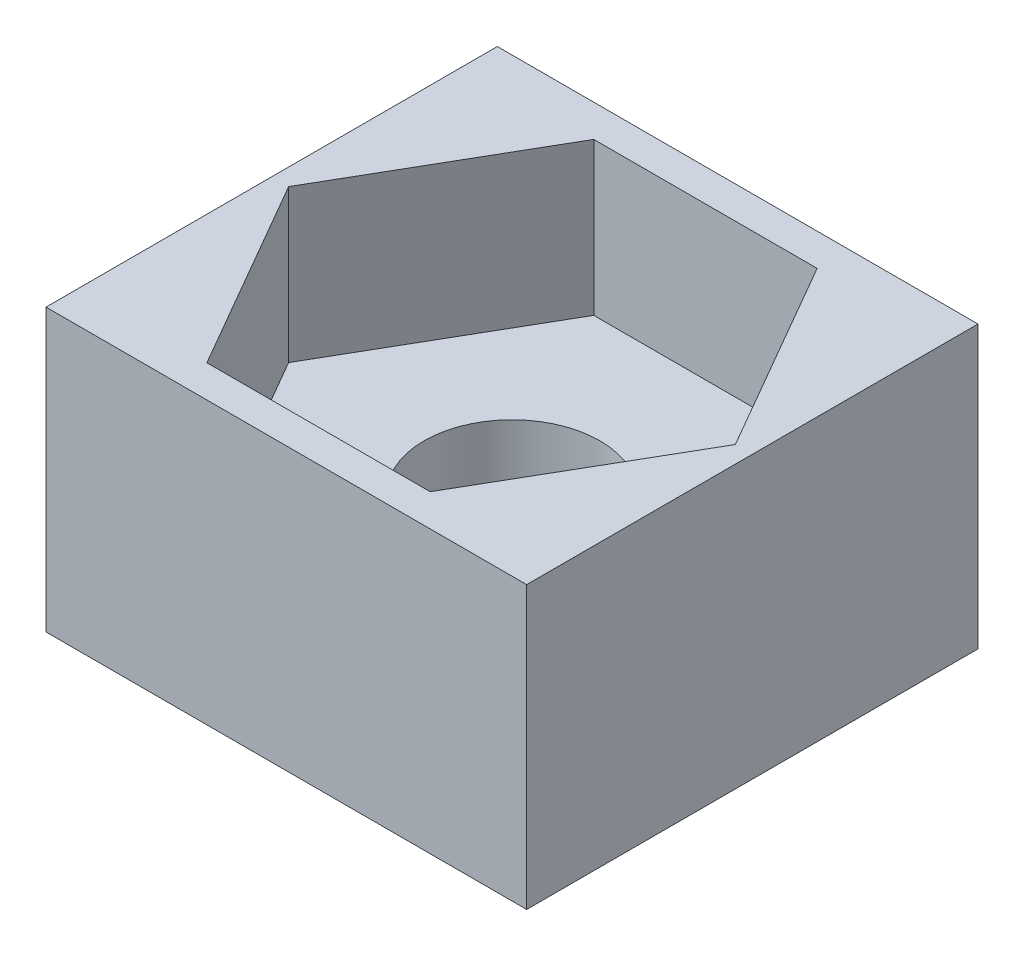
ISO-10303-21;
HEADER;
FILE_DESCRIPTION(('STEP AP214'),'2;1');
FILE_NAME('part.step','',(''),(''),'','','');
FILE_SCHEMA(('AUTOMOTIVE_DESIGN { 1 0 10303 214 1 1 1 1 }'));
ENDSEC;
DATA;
#1=APPLICATION_CONTEXT('core data for automotive mechanical design processes');
#2=APPLICATION_PROTOCOL_DEFINITION('international standard','automotive_design',2000,#1);
#3=PRODUCT_CONTEXT('',#1,'mechanical');
#4=PRODUCT('Part','Part','',(#3));
#5=PRODUCT_RELATED_PRODUCT_CATEGORY('part','',(#4));
#6=PRODUCT_DEFINITION_FORMATION('','',#4);
#7=PRODUCT_DEFINITION_CONTEXT('part definition',#1,'design');
#8=PRODUCT_DEFINITION('design','',#6,#7);
#9=PRODUCT_DEFINITION_SHAPE('','',#8);
#10=(LENGTH_UNIT() NAMED_UNIT(*) SI_UNIT(.MILLI.,.METRE.));
#11=(NAMED_UNIT(*) PLANE_ANGLE_UNIT() SI_UNIT($,.RADIAN.));
#12=(NAMED_UNIT(*) SI_UNIT($,.STERADIAN.) SOLID_ANGLE_UNIT());
#13=UNCERTAINTY_MEASURE_WITH_UNIT(LENGTH_MEASURE(1.E-05),#10,'distance_accuracy_value','');
#14=(GEOMETRIC_REPRESENTATION_CONTEXT(3) GLOBAL_UNCERTAINTY_ASSIGNED_CONTEXT((#13)) GLOBAL_UNIT_ASSIGNED_CONTEXT((#10,
#11,#12)) REPRESENTATION_CONTEXT('',''));
#15=CARTESIAN_POINT('',(0.,0.,0.));
#16=DIRECTION('',(0.,0.,1.));
#17=DIRECTION('',(1.,0.,0.));
#18=AXIS2_PLACEMENT_3D('',#15,#16,#17);
#19=CARTESIAN_POINT('',(2.85788383248865,4.8,1.65));
#20=DIRECTION('',(-0.866025403784439,0.,-0.5));
#21=DIRECTION('',(-0.5,0.,0.866025403784439));
#22=AXIS2_PLACEMENT_3D('',#19,#20,#21);
#23=PLANE('',#22);
#24=DIRECTION('',(0.5,0.,-0.866025403784439));
#25=VECTOR('',#24,1.);
#26=CARTESIAN_POINT('',(2.85788383248865,2.2,1.65));
#27=LINE('',#26,#25);
#28=CARTESIAN_POINT('',(1.90525588832576,2.2,3.3));
#29=VERTEX_POINT('',#28);
#30=CARTESIAN_POINT('',(3.81051177665153,2.2,0.));
#31=VERTEX_POINT('',#30);
#32=EDGE_CURVE('E51',#29,#31,#27,.T.);
#33=ORIENTED_EDGE('',*,*,#32,.F.);
#34=DIRECTION('',(0.,-1.,0.));
#35=VECTOR('',#34,1.);
#36=CARTESIAN_POINT('',(1.90525588832576,4.8,3.3));
#37=LINE('',#36,#35);
#38=CARTESIAN_POINT('',(1.90525588832576,4.8,3.3));
#39=VERTEX_POINT('',#38);
#40=EDGE_CURVE('E11',#39,#29,#37,.T.);
#41=ORIENTED_EDGE('',*,*,#40,.F.);
#42=DIRECTION('',(0.5,0.,-0.866025403784439));
#43=VECTOR('',#42,1.);
#44=CARTESIAN_POINT('',(2.85788383248865,4.8,1.65));
#45=LINE('',#44,#43);
#46=CARTESIAN_POINT('',(3.81051177665153,4.8,0.));
#47=VERTEX_POINT('',#46);
#48=EDGE_CURVE('E158',#39,#47,#45,.T.);
#49=ORIENTED_EDGE('',*,*,#48,.T.);
#50=DIRECTION('',(0.,-1.,0.));
#51=VECTOR('',#50,1.);
#52=CARTESIAN_POINT('',(3.81051177665153,4.8,0.));
#53=LINE('',#52,#51);
#54=EDGE_CURVE('E123',#47,#31,#53,.T.);
#55=ORIENTED_EDGE('',*,*,#54,.T.);
#56=EDGE_LOOP('',(#33,#41,#49,#55));
#57=FACE_BOUND('',#56,.T.);
#58=ADVANCED_FACE('F34',(#57),#23,.T.);
#59=CARTESIAN_POINT('',(0.,4.8,3.3));
#60=DIRECTION('',(0.,0.,-1.));
#61=DIRECTION('',(-1.,0.,0.));
#62=AXIS2_PLACEMENT_3D('',#59,#60,#61);
#63=PLANE('',#62);
#64=DIRECTION('',(1.,0.,0.));
#65=VECTOR('',#64,1.);
#66=CARTESIAN_POINT('',(0.,2.2,3.3));
#67=LINE('',#66,#65);
#68=CARTESIAN_POINT('',(-1.90525588832577,2.2,3.3));
#69=VERTEX_POINT('',#68);
#70=EDGE_CURVE('E57',#69,#29,#67,.T.);
#71=ORIENTED_EDGE('',*,*,#70,.F.);
#72=DIRECTION('',(0.,-1.,0.));
#73=VECTOR('',#72,1.);
#74=CARTESIAN_POINT('',(-1.90525588832577,4.8,3.3));
#75=LINE('',#74,#73);
#76=CARTESIAN_POINT('',(-1.90525588832577,4.8,3.3));
#77=VERTEX_POINT('',#76);
#78=EDGE_CURVE('E43',#77,#69,#75,.T.);
#79=ORIENTED_EDGE('',*,*,#78,.F.);
#80=DIRECTION('',(1.,0.,0.));
#81=VECTOR('',#80,1.);
#82=CARTESIAN_POINT('',(0.,4.8,3.3));
#83=LINE('',#82,#81);
#84=EDGE_CURVE('E161',#77,#39,#83,.T.);
#85=ORIENTED_EDGE('',*,*,#84,.T.);
#86=ORIENTED_EDGE('',*,*,#40,.T.);
#87=EDGE_LOOP('',(#71,#79,#85,#86));
#88=FACE_BOUND('',#87,.T.);
#89=ADVANCED_FACE('F221',(#88),#63,.T.);
#90=CARTESIAN_POINT('',(-2.85788383248865,4.8,1.65));
#91=DIRECTION('',(0.866025403784439,0.,-0.5));
#92=DIRECTION('',(-0.5,0.,-0.866025403784439));
#93=AXIS2_PLACEMENT_3D('',#90,#91,#92);
#94=PLANE('',#93);
#95=DIRECTION('',(0.5,0.,0.866025403784439));
#96=VECTOR('',#95,1.);
#97=CARTESIAN_POINT('',(-2.85788383248865,2.2,1.65));
#98=LINE('',#97,#96);
#99=CARTESIAN_POINT('',(-3.81051177665153,2.2,0.));
#100=VERTEX_POINT('',#99);
#101=EDGE_CURVE('E139',#100,#69,#98,.T.);
#102=ORIENTED_EDGE('',*,*,#101,.F.);
#103=DIRECTION('',(0.,-1.,0.));
#104=VECTOR('',#103,1.);
#105=CARTESIAN_POINT('',(-3.81051177665153,4.8,0.));
#106=LINE('',#105,#104);
#107=CARTESIAN_POINT('',(-3.81051177665153,4.8,0.));
#108=VERTEX_POINT('',#107);
#109=EDGE_CURVE('E185',#108,#100,#106,.T.);
#110=ORIENTED_EDGE('',*,*,#109,.F.);
#111=DIRECTION('',(0.5,0.,0.866025403784439));
#112=VECTOR('',#111,1.);
#113=CARTESIAN_POINT('',(-2.85788383248865,4.8,1.65));
#114=LINE('',#113,#112);
#115=EDGE_CURVE('E164',#108,#77,#114,.T.);
#116=ORIENTED_EDGE('',*,*,#115,.T.);
#117=ORIENTED_EDGE('',*,*,#78,.T.);
#118=EDGE_LOOP('',(#102,#110,#116,#117));
#119=FACE_BOUND('',#118,.T.);
#120=ADVANCED_FACE('F223',(#119),#94,.T.);
#121=CARTESIAN_POINT('',(-2.85788383248865,4.8,-1.65));
#122=DIRECTION('',(0.866025403784439,0.,0.5));
#123=DIRECTION('',(0.5,0.,-0.866025403784439));
#124=AXIS2_PLACEMENT_3D('',#121,#122,#123);
#125=PLANE('',#124);
#126=DIRECTION('',(-0.5,0.,0.866025403784439));
#127=VECTOR('',#126,1.);
#128=CARTESIAN_POINT('',(-2.85788383248865,2.2,-1.65));
#129=LINE('',#128,#127);
#130=CARTESIAN_POINT('',(-1.90525588832576,2.2,-3.3));
#131=VERTEX_POINT('',#130);
#132=EDGE_CURVE('E131',#131,#100,#129,.T.);
#133=ORIENTED_EDGE('',*,*,#132,.F.);
#134=DIRECTION('',(0.,-1.,0.));
#135=VECTOR('',#134,1.);
#136=CARTESIAN_POINT('',(-1.90525588832576,4.8,-3.3));
#137=LINE('',#136,#135);
#138=CARTESIAN_POINT('',(-1.90525588832576,4.8,-3.3));
#139=VERTEX_POINT('',#138);
#140=EDGE_CURVE('E122',#139,#131,#137,.T.);
#141=ORIENTED_EDGE('',*,*,#140,.F.);
#142=DIRECTION('',(-0.5,0.,0.866025403784439));
#143=VECTOR('',#142,1.);
#144=CARTESIAN_POINT('',(-2.85788383248865,4.8,-1.65));
#145=LINE('',#144,#143);
#146=EDGE_CURVE('E167',#139,#108,#145,.T.);
#147=ORIENTED_EDGE('',*,*,#146,.T.);
#148=ORIENTED_EDGE('',*,*,#109,.T.);
#149=EDGE_LOOP('',(#133,#141,#147,#148));
#150=FACE_BOUND('',#149,.T.);
#151=ADVANCED_FACE('F225',(#150),#125,.T.);
#152=CARTESIAN_POINT('',(0.,4.8,-3.3));
#153=DIRECTION('',(0.,0.,1.));
#154=DIRECTION('',(1.,0.,0.));
#155=AXIS2_PLACEMENT_3D('',#152,#153,#154);
#156=PLANE('',#155);
#157=DIRECTION('',(-1.,0.,0.));
#158=VECTOR('',#157,1.);
#159=CARTESIAN_POINT('',(0.,2.2,-3.3));
#160=LINE('',#159,#158);
#161=CARTESIAN_POINT('',(1.90525588832576,2.2,-3.3));
#162=VERTEX_POINT('',#161);
#163=EDGE_CURVE('E127',#162,#131,#160,.T.);
#164=ORIENTED_EDGE('',*,*,#163,.F.);
#165=DIRECTION('',(0.,-1.,0.));
#166=VECTOR('',#165,1.);
#167=CARTESIAN_POINT('',(1.90525588832576,4.8,-3.3));
#168=LINE('',#167,#166);
#169=CARTESIAN_POINT('',(1.90525588832576,4.8,-3.3));
#170=VERTEX_POINT('',#169);
#171=EDGE_CURVE('E112',#170,#162,#168,.T.);
#172=ORIENTED_EDGE('',*,*,#171,.F.);
#173=DIRECTION('',(-1.,0.,0.));
#174=VECTOR('',#173,1.);
#175=CARTESIAN_POINT('',(0.,4.8,-3.3));
#176=LINE('',#175,#174);
#177=EDGE_CURVE('E170',#170,#139,#176,.T.);
#178=ORIENTED_EDGE('',*,*,#177,.T.);
#179=ORIENTED_EDGE('',*,*,#140,.T.);
#180=EDGE_LOOP('',(#164,#172,#178,#179));
#181=FACE_BOUND('',#180,.T.);
#182=ADVANCED_FACE('F128',(#181),#156,.T.);
#183=CARTESIAN_POINT('',(4.1,4.8,0.));
#184=DIRECTION('',(1.,0.,0.));
#185=DIRECTION('',(0.,0.,-1.));
#186=AXIS2_PLACEMENT_3D('',#183,#184,#185);
#187=PLANE('',#186);
#188=DIRECTION('',(0.,0.,1.));
#189=VECTOR('',#188,1.);
#190=CARTESIAN_POINT('',(4.1,0.,0.));
#191=LINE('',#190,#189);
#192=CARTESIAN_POINT('',(4.1,0.,-3.85));
#193=VERTEX_POINT('',#192);
#194=CARTESIAN_POINT('',(4.1,0.,3.85));
#195=VERTEX_POINT('',#194);
#196=EDGE_CURVE('E142',#193,#195,#191,.T.);
#197=ORIENTED_EDGE('',*,*,#196,.F.);
#198=DIRECTION('',(0.,-1.,0.));
#199=VECTOR('',#198,1.);
#200=CARTESIAN_POINT('',(4.1,4.8,-3.85));
#201=LINE('',#200,#199);
#202=CARTESIAN_POINT('',(4.1,4.8,-3.85));
#203=VERTEX_POINT('',#202);
#204=EDGE_CURVE('E38',#203,#193,#201,.T.);
#205=ORIENTED_EDGE('',*,*,#204,.F.);
#206=DIRECTION('',(0.,0.,1.));
#207=VECTOR('',#206,1.);
#208=CARTESIAN_POINT('',(4.1,4.8,0.));
#209=LINE('',#208,#207);
#210=CARTESIAN_POINT('',(4.1,4.8,3.85));
#211=VERTEX_POINT('',#210);
#212=EDGE_CURVE('E147',#203,#211,#209,.T.);
#213=ORIENTED_EDGE('',*,*,#212,.T.);
#214=DIRECTION('',(0.,-1.,0.));
#215=VECTOR('',#214,1.);
#216=CARTESIAN_POINT('',(4.1,4.8,3.85));
#217=LINE('',#216,#215);
#218=EDGE_CURVE('E173',#211,#195,#217,.T.);
#219=ORIENTED_EDGE('',*,*,#218,.T.);
#220=EDGE_LOOP('',(#197,#205,#213,#219));
#221=FACE_BOUND('',#220,.T.);
#222=ADVANCED_FACE('F36',(#221),#187,.T.);
#223=CARTESIAN_POINT('',(0.,4.8,-3.85));
#224=DIRECTION('',(0.,0.,-1.));
#225=DIRECTION('',(-1.,0.,0.));
#226=AXIS2_PLACEMENT_3D('',#223,#224,#225);
#227=PLANE('',#226);
#228=DIRECTION('',(1.,0.,0.));
#229=VECTOR('',#228,1.);
#230=CARTESIAN_POINT('',(0.,0.,-3.85));
#231=LINE('',#230,#229);
#232=CARTESIAN_POINT('',(-4.1,0.,-3.85));
#233=VERTEX_POINT('',#232);
#234=EDGE_CURVE('E176',#233,#193,#231,.T.);
#235=ORIENTED_EDGE('',*,*,#234,.F.);
#236=DIRECTION('',(0.,-1.,0.));
#237=VECTOR('',#236,1.);
#238=CARTESIAN_POINT('',(-4.1,4.8,-3.85));
#239=LINE('',#238,#237);
#240=CARTESIAN_POINT('',(-4.1,4.8,-3.85));
#241=VERTEX_POINT('',#240);
#242=EDGE_CURVE('E192',#241,#233,#239,.T.);
#243=ORIENTED_EDGE('',*,*,#242,.F.);
#244=DIRECTION('',(1.,0.,0.));
#245=VECTOR('',#244,1.);
#246=CARTESIAN_POINT('',(0.,4.8,-3.85));
#247=LINE('',#246,#245);
#248=EDGE_CURVE('E150',#241,#203,#247,.T.);
#249=ORIENTED_EDGE('',*,*,#248,.T.);
#250=ORIENTED_EDGE('',*,*,#204,.T.);
#251=EDGE_LOOP('',(#235,#243,#249,#250));
#252=FACE_BOUND('',#251,.T.);
#253=ADVANCED_FACE('F199',(#252),#227,.T.);
#254=CARTESIAN_POINT('',(-4.1,4.8,0.));
#255=DIRECTION('',(1.,0.,0.));
#256=DIRECTION('',(0.,0.,-1.));
#257=AXIS2_PLACEMENT_3D('',#254,#255,#256);
#258=PLANE('',#257);
#259=DIRECTION('',(0.,0.,1.));
#260=VECTOR('',#259,1.);
#261=CARTESIAN_POINT('',(-4.1,0.,0.));
#262=LINE('',#261,#260);
#263=CARTESIAN_POINT('',(-4.1,0.,3.85));
#264=VERTEX_POINT('',#263);
#265=EDGE_CURVE('E179',#233,#264,#262,.T.);
#266=ORIENTED_EDGE('',*,*,#265,.T.);
#267=DIRECTION('',(0.,-1.,0.));
#268=VECTOR('',#267,1.);
#269=CARTESIAN_POINT('',(-4.1,4.8,3.85));
#270=LINE('',#269,#268);
#271=CARTESIAN_POINT('',(-4.1,4.8,3.85));
#272=VERTEX_POINT('',#271);
#273=EDGE_CURVE('E190',#272,#264,#270,.T.);
#274=ORIENTED_EDGE('',*,*,#273,.F.);
#275=DIRECTION('',(0.,0.,1.));
#276=VECTOR('',#275,1.);
#277=CARTESIAN_POINT('',(-4.1,4.8,0.));
#278=LINE('',#277,#276);
#279=EDGE_CURVE('E154',#241,#272,#278,.T.);
#280=ORIENTED_EDGE('',*,*,#279,.F.);
#281=ORIENTED_EDGE('',*,*,#242,.T.);
#282=EDGE_LOOP('',(#266,#274,#280,#281));
#283=FACE_BOUND('',#282,.T.);
#284=ADVANCED_FACE('F209',(#283),#258,.F.);
#285=CARTESIAN_POINT('',(0.,4.8,3.85));
#286=DIRECTION('',(0.,0.,-1.));
#287=DIRECTION('',(-1.,0.,0.));
#288=AXIS2_PLACEMENT_3D('',#285,#286,#287);
#289=PLANE('',#288);
#290=DIRECTION('',(1.,0.,0.));
#291=VECTOR('',#290,1.);
#292=CARTESIAN_POINT('',(0.,0.,3.85));
#293=LINE('',#292,#291);
#294=EDGE_CURVE('E151',#264,#195,#293,.T.);
#295=ORIENTED_EDGE('',*,*,#294,.T.);
#296=ORIENTED_EDGE('',*,*,#218,.F.);
#297=DIRECTION('',(1.,0.,0.));
#298=VECTOR('',#297,1.);
#299=CARTESIAN_POINT('',(0.,4.8,3.85));
#300=LINE('',#299,#298);
#301=EDGE_CURVE('E156',#272,#211,#300,.T.);
#302=ORIENTED_EDGE('',*,*,#301,.F.);
#303=ORIENTED_EDGE('',*,*,#273,.T.);
#304=EDGE_LOOP('',(#295,#296,#302,#303));
#305=FACE_BOUND('',#304,.T.);
#306=ADVANCED_FACE('F212',(#305),#289,.F.);
#307=CARTESIAN_POINT('',(2.85788383248865,4.8,-1.65));
#308=DIRECTION('',(-0.866025403784439,0.,0.5));
#309=DIRECTION('',(0.5,0.,0.866025403784439));
#310=AXIS2_PLACEMENT_3D('',#307,#308,#309);
#311=PLANE('',#310);
#312=DIRECTION('',(-0.5,0.,-0.866025403784439));
#313=VECTOR('',#312,1.);
#314=CARTESIAN_POINT('',(2.85788383248865,2.2,-1.65));
#315=LINE('',#314,#313);
#316=EDGE_CURVE('E116',#31,#162,#315,.T.);
#317=ORIENTED_EDGE('',*,*,#316,.F.);
#318=ORIENTED_EDGE('',*,*,#54,.F.);
#319=DIRECTION('',(-0.5,0.,-0.866025403784439));
#320=VECTOR('',#319,1.);
#321=CARTESIAN_POINT('',(2.85788383248865,4.8,-1.65));
#322=LINE('',#321,#320);
#323=EDGE_CURVE('E118',#47,#170,#322,.T.);
#324=ORIENTED_EDGE('',*,*,#323,.T.);
#325=ORIENTED_EDGE('',*,*,#171,.T.);
#326=EDGE_LOOP('',(#317,#318,#324,#325));
#327=FACE_BOUND('',#326,.T.);
#328=ADVANCED_FACE('F114',(#327),#311,.T.);
#329=CARTESIAN_POINT('',(0.,4.8,0.));
#330=DIRECTION('',(0.,1.,0.));
#331=DIRECTION('',(0.,0.,1.));
#332=AXIS2_PLACEMENT_3D('',#329,#330,#331);
#333=PLANE('',#332);
#334=ORIENTED_EDGE('',*,*,#212,.F.);
#335=ORIENTED_EDGE('',*,*,#248,.F.);
#336=ORIENTED_EDGE('',*,*,#279,.T.);
#337=ORIENTED_EDGE('',*,*,#301,.T.);
#338=EDGE_LOOP('',(#334,#335,#336,#337));
#339=FACE_BOUND('',#338,.T.);
#340=ORIENTED_EDGE('',*,*,#48,.F.);
#341=ORIENTED_EDGE('',*,*,#84,.F.);
#342=ORIENTED_EDGE('',*,*,#115,.F.);
#343=ORIENTED_EDGE('',*,*,#146,.F.);
#344=ORIENTED_EDGE('',*,*,#177,.F.);
#345=ORIENTED_EDGE('',*,*,#323,.F.);
#346=EDGE_LOOP('',(#340,#341,#342,#343,#344,#345));
#347=FACE_BOUND('',#346,.T.);
#348=ADVANCED_FACE('F214',(#339,#347),#333,.T.);
#349=CARTESIAN_POINT('',(0.,0.,0.));
#350=DIRECTION('',(0.,1.,0.));
#351=DIRECTION('',(0.,0.,1.));
#352=AXIS2_PLACEMENT_3D('',#349,#350,#351);
#353=PLANE('',#352);
#354=ORIENTED_EDGE('',*,*,#196,.T.);
#355=ORIENTED_EDGE('',*,*,#294,.F.);
#356=ORIENTED_EDGE('',*,*,#265,.F.);
#357=ORIENTED_EDGE('',*,*,#234,.T.);
#358=EDGE_LOOP('',(#354,#355,#356,#357));
#359=FACE_BOUND('',#358,.T.);
#360=CARTESIAN_POINT('',(0.,0.,0.));
#361=DIRECTION('',(0.,1.,0.));
#362=DIRECTION('',(0.,0.,1.));
#363=AXIS2_PLACEMENT_3D('',#360,#361,#362);
#364=CIRCLE('',#363,1.5);
#365=CARTESIAN_POINT('',(0.,0.,1.5));
#366=VERTEX_POINT('',#365);
#367=EDGE_CURVE('E143',#366,#366,#364,.T.);
#368=ORIENTED_EDGE('',*,*,#367,.T.);
#369=EDGE_LOOP('',(#368));
#370=FACE_BOUND('',#369,.T.);
#371=ADVANCED_FACE('F206',(#359,#370),#353,.F.);
#372=CARTESIAN_POINT('',(0.,2.2,0.));
#373=DIRECTION('',(0.,-1.,0.));
#374=DIRECTION('',(0.,0.,-1.));
#375=AXIS2_PLACEMENT_3D('',#372,#373,#374);
#376=CYLINDRICAL_SURFACE('',#375,1.5);
#377=CARTESIAN_POINT('',(0.,2.2,0.));
#378=DIRECTION('',(0.,1.,0.));
#379=DIRECTION('',(0.,0.,1.));
#380=AXIS2_PLACEMENT_3D('',#377,#378,#379);
#381=CIRCLE('',#380,1.5);
#382=CARTESIAN_POINT('',(0.,2.2,1.5));
#383=VERTEX_POINT('',#382);
#384=EDGE_CURVE('E146',#383,#383,#381,.T.);
#385=ORIENTED_EDGE('',*,*,#384,.T.);
#386=EDGE_LOOP('',(#385));
#387=FACE_BOUND('',#386,.T.);
#388=ORIENTED_EDGE('',*,*,#367,.F.);
#389=EDGE_LOOP('',(#388));
#390=FACE_BOUND('',#389,.T.);
#391=ADVANCED_FACE('F277',(#387,#390),#376,.F.);
#392=CARTESIAN_POINT('',(0.,2.2,0.));
#393=DIRECTION('',(0.,1.,0.));
#394=DIRECTION('',(0.,0.,1.));
#395=AXIS2_PLACEMENT_3D('',#392,#393,#394);
#396=PLANE('',#395);
#397=ORIENTED_EDGE('',*,*,#384,.F.);
#398=EDGE_LOOP('',(#397));
#399=FACE_BOUND('',#398,.T.);
#400=ORIENTED_EDGE('',*,*,#70,.T.);
#401=ORIENTED_EDGE('',*,*,#32,.T.);
#402=ORIENTED_EDGE('',*,*,#316,.T.);
#403=ORIENTED_EDGE('',*,*,#163,.T.);
#404=ORIENTED_EDGE('',*,*,#132,.T.);
#405=ORIENTED_EDGE('',*,*,#101,.T.);
#406=EDGE_LOOP('',(#400,#401,#402,#403,#404,#405));
#407=FACE_BOUND('',#406,.T.);
#408=ADVANCED_FACE('F133',(#399,#407),#396,.T.);
#409=CLOSED_SHELL('',(#58,#89,#120,#151,#182,#222,#253,#284,#306,#328,#348,#371,#391,#408));
#410=MANIFOLD_SOLID_BREP('B2',#409);
#411=ADVANCED_BREP_SHAPE_REPRESENTATION('',(#18,#410),#14);
#412=SHAPE_DEFINITION_REPRESENTATION(#9,#411);
ENDSEC;
END-ISO-10303-21;
